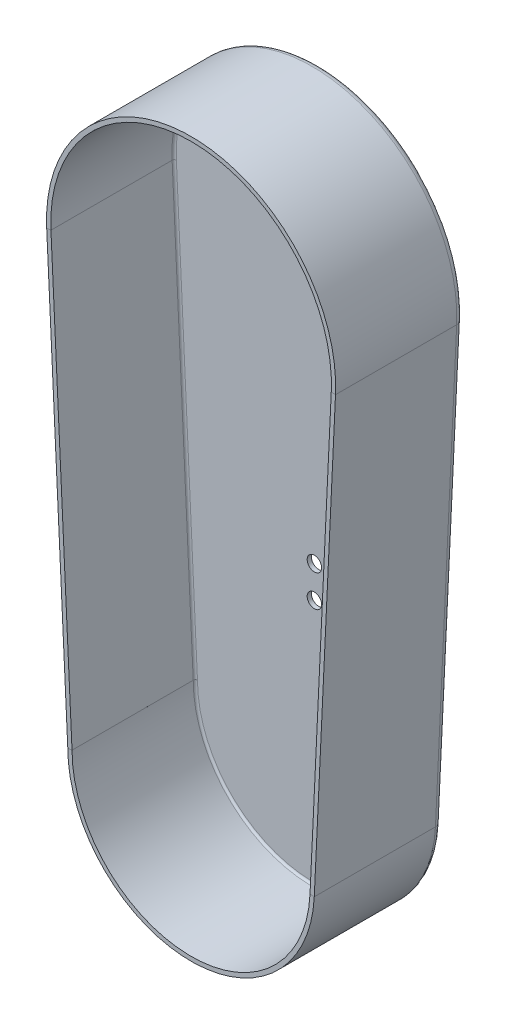
ISO-10303-21;
HEADER;
FILE_DESCRIPTION(('STEP AP214'),'2;1');
FILE_NAME('part.step','',(''),(''),'','','');
FILE_SCHEMA(('AUTOMOTIVE_DESIGN { 1 0 10303 214 1 1 1 1 }'));
ENDSEC;
DATA;
#1=APPLICATION_CONTEXT('core data for automotive mechanical design processes');
#2=APPLICATION_PROTOCOL_DEFINITION('international standard','automotive_design',2000,#1);
#3=PRODUCT_CONTEXT('',#1,'mechanical');
#4=PRODUCT('Part','Part','',(#3));
#5=PRODUCT_RELATED_PRODUCT_CATEGORY('part','',(#4));
#6=PRODUCT_DEFINITION_FORMATION('','',#4);
#7=PRODUCT_DEFINITION_CONTEXT('part definition',#1,'design');
#8=PRODUCT_DEFINITION('design','',#6,#7);
#9=PRODUCT_DEFINITION_SHAPE('','',#8);
#10=(LENGTH_UNIT() NAMED_UNIT(*) SI_UNIT(.MILLI.,.METRE.));
#11=(NAMED_UNIT(*) PLANE_ANGLE_UNIT() SI_UNIT($,.RADIAN.));
#12=(NAMED_UNIT(*) SI_UNIT($,.STERADIAN.) SOLID_ANGLE_UNIT());
#13=UNCERTAINTY_MEASURE_WITH_UNIT(LENGTH_MEASURE(1.E-05),#10,'distance_accuracy_value','');
#14=(GEOMETRIC_REPRESENTATION_CONTEXT(3) GLOBAL_UNCERTAINTY_ASSIGNED_CONTEXT((#13)) GLOBAL_UNIT_ASSIGNED_CONTEXT((#10,
#11,#12)) REPRESENTATION_CONTEXT('',''));
#15=CARTESIAN_POINT('',(0.,0.,0.));
#16=DIRECTION('',(0.,0.,1.));
#17=DIRECTION('',(1.,0.,0.));
#18=AXIS2_PLACEMENT_3D('',#15,#16,#17);
#19=CARTESIAN_POINT('',(-55.,0.,1.));
#20=DIRECTION('',(-0.047919928966273,0.998851180310594,0.));
#21=DIRECTION('',(-0.998851180310594,-0.047919928966273,0.));
#22=AXIS2_PLACEMENT_3D('',#19,#20,#21);
#23=PLANE('',#22);
#24=DIRECTION('',(0.998851180310594,0.0479199289662717,0.));
#25=VECTOR('',#24,1.);
#26=CARTESIAN_POINT('',(-55.9988511803106,-0.0479199289662724,0.999999999999999));
#27=LINE('',#26,#25);
#28=CARTESIAN_POINT('',(-57.9965535409318,-0.143759786898928,1.));
#29=VERTEX_POINT('',#28);
#30=CARTESIAN_POINT('',(-55.9988511803106,-0.0479199289662724,0.999999999999999));
#31=VERTEX_POINT('',#30);
#32=EDGE_CURVE('E228',#29,#31,#27,.T.);
#33=ORIENTED_EDGE('',*,*,#32,.F.);
#34=CARTESIAN_POINT('',(-55.,0.,1.));
#35=DIRECTION('',(0.047919928966273,-0.998851180310594,0.));
#36=DIRECTION('',(0.998851180310594,0.047919928966273,0.));
#37=AXIS2_PLACEMENT_3D('',#34,#35,#36);
#38=CIRCLE('',#37,3.);
#39=CARTESIAN_POINT('',(-54.9999999999999,0.,-2.));
#40=VERTEX_POINT('',#39);
#41=EDGE_CURVE('E322',#40,#29,#38,.F.);
#42=ORIENTED_EDGE('',*,*,#41,.F.);
#43=DIRECTION('',(0.,0.,1.));
#44=VECTOR('',#43,1.);
#45=CARTESIAN_POINT('',(-55.,0.,-2.));
#46=LINE('',#45,#44);
#47=CARTESIAN_POINT('',(-54.9999999999999,0.,0.));
#48=VERTEX_POINT('',#47);
#49=EDGE_CURVE('E178',#40,#48,#46,.T.);
#50=ORIENTED_EDGE('',*,*,#49,.T.);
#51=CARTESIAN_POINT('',(-55.,0.,1.));
#52=DIRECTION('',(0.047919928966273,-0.998851180310594,0.));
#53=DIRECTION('',(0.998851180310594,0.047919928966273,0.));
#54=AXIS2_PLACEMENT_3D('',#51,#52,#53);
#55=CIRCLE('',#54,1.);
#56=EDGE_CURVE('E298',#48,#31,#55,.F.);
#57=ORIENTED_EDGE('',*,*,#56,.T.);
#58=EDGE_LOOP('',(#33,#42,#50,#57));
#59=FACE_BOUND('',#58,.T.);
#60=ADVANCED_FACE('F174',(#59),#23,.F.);
#61=CARTESIAN_POINT('',(54.9376063327222,-2.61904761904764,1.));
#62=DIRECTION('',(-0.0476190476190477,-0.998865569685859,0.));
#63=DIRECTION('',(0.998865569685859,-0.0476190476190477,0.));
#64=AXIS2_PLACEMENT_3D('',#61,#62,#63);
#65=PLANE('',#64);
#66=DIRECTION('',(0.,0.,1.));
#67=VECTOR('',#66,1.);
#68=CARTESIAN_POINT('',(54.9376063327222,-2.61904761904762,-2.));
#69=LINE('',#68,#67);
#70=CARTESIAN_POINT('',(54.9376063327222,-2.61904761904764,-2.));
#71=VERTEX_POINT('',#70);
#72=CARTESIAN_POINT('',(54.9376063327222,-2.61904761904764,0.));
#73=VERTEX_POINT('',#72);
#74=EDGE_CURVE('E12',#71,#73,#69,.T.);
#75=ORIENTED_EDGE('',*,*,#74,.F.);
#76=CARTESIAN_POINT('',(54.9376063327222,-2.61904761904764,1.));
#77=DIRECTION('',(0.0476190476190477,0.998865569685859,0.));
#78=DIRECTION('',(-0.998865569685859,0.0476190476190477,0.));
#79=AXIS2_PLACEMENT_3D('',#76,#77,#78);
#80=CIRCLE('',#79,3.);
#81=CARTESIAN_POINT('',(57.9342030417798,-2.76190476190478,0.999999999999998));
#82=VERTEX_POINT('',#81);
#83=EDGE_CURVE('E347',#71,#82,#80,.F.);
#84=ORIENTED_EDGE('',*,*,#83,.T.);
#85=DIRECTION('',(-0.998865569685859,0.0476190476190477,0.));
#86=VECTOR('',#85,1.);
#87=CARTESIAN_POINT('',(55.936471902408,-2.66666666666669,0.999999999999999));
#88=LINE('',#87,#86);
#89=CARTESIAN_POINT('',(55.936471902408,-2.66666666666669,0.999999999999999));
#90=VERTEX_POINT('',#89);
#91=EDGE_CURVE('E356',#82,#90,#88,.T.);
#92=ORIENTED_EDGE('',*,*,#91,.T.);
#93=CARTESIAN_POINT('',(54.9376063327222,-2.61904761904764,1.));
#94=DIRECTION('',(0.0476190476190477,0.998865569685859,0.));
#95=DIRECTION('',(-0.998865569685858,0.0476190476190477,0.));
#96=AXIS2_PLACEMENT_3D('',#93,#94,#95);
#97=CIRCLE('',#96,1.);
#98=EDGE_CURVE('E342',#73,#90,#97,.F.);
#99=ORIENTED_EDGE('',*,*,#98,.F.);
#100=EDGE_LOOP('',(#75,#84,#92,#99));
#101=FACE_BOUND('',#100,.T.);
#102=ADVANCED_FACE('F393',(#101),#65,.T.);
#103=CARTESIAN_POINT('',(55.936471902408,-2.66666666666669,0.));
#104=DIRECTION('',(-0.0476190476190477,-0.998865569685859,0.));
#105=DIRECTION('',(0.,0.,1.));
#106=AXIS2_PLACEMENT_3D('',#103,#104,#105);
#107=PLANE('',#106);
#108=ORIENTED_EDGE('',*,*,#91,.F.);
#109=DIRECTION('',(0.,0.,1.));
#110=VECTOR('',#109,1.);
#111=CARTESIAN_POINT('',(57.9342030417798,-2.76190476190478,0.));
#112=LINE('',#111,#110);
#113=CARTESIAN_POINT('',(57.9342030417798,-2.76190476190478,58.));
#114=VERTEX_POINT('',#113);
#115=EDGE_CURVE('E338',#82,#114,#112,.T.);
#116=ORIENTED_EDGE('',*,*,#115,.T.);
#117=DIRECTION('',(-0.998865569685859,0.0476190476190477,0.));
#118=VECTOR('',#117,1.);
#119=CARTESIAN_POINT('',(55.936471902408,-2.66666666666669,58.));
#120=LINE('',#119,#118);
#121=CARTESIAN_POINT('',(55.936471902408,-2.66666666666669,58.));
#122=VERTEX_POINT('',#121);
#123=EDGE_CURVE('E277',#114,#122,#120,.T.);
#124=ORIENTED_EDGE('',*,*,#123,.T.);
#125=DIRECTION('',(0.,0.,1.));
#126=VECTOR('',#125,1.);
#127=CARTESIAN_POINT('',(55.936471902408,-2.66666666666669,0.));
#128=LINE('',#127,#126);
#129=EDGE_CURVE('E289',#90,#122,#128,.T.);
#130=ORIENTED_EDGE('',*,*,#129,.F.);
#131=EDGE_LOOP('',(#108,#116,#124,#130));
#132=FACE_BOUND('',#131,.T.);
#133=ADVANCED_FACE('F432',(#132),#107,.T.);
#134=CARTESIAN_POINT('',(55.936471902408,-2.66666666666669,58.));
#135=DIRECTION('',(0.,0.,1.));
#136=DIRECTION('',(0.0476190476190477,0.998865569685859,0.));
#137=AXIS2_PLACEMENT_3D('',#134,#135,#136);
#138=PLANE('',#137);
#139=ORIENTED_EDGE('',*,*,#123,.F.);
#140=DIRECTION('',(-0.0476190476190477,-0.998865569685859,0.));
#141=VECTOR('',#140,1.);
#142=CARTESIAN_POINT('',(57.9342030417798,-2.76190476190478,58.));
#143=LINE('',#142,#141);
#144=CARTESIAN_POINT('',(67.9228587386384,206.761904761905,58.));
#145=VERTEX_POINT('',#144);
#146=EDGE_CURVE('E272',#114,#145,#143,.F.);
#147=ORIENTED_EDGE('',*,*,#146,.T.);
#148=DIRECTION('',(-0.998865569685858,0.047619047619048,0.));
#149=VECTOR('',#148,1.);
#150=CARTESIAN_POINT('',(65.9251275992666,206.857142857143,58.));
#151=LINE('',#150,#149);
#152=CARTESIAN_POINT('',(65.9251275992666,206.857142857143,58.));
#153=VERTEX_POINT('',#152);
#154=EDGE_CURVE('E267',#145,#153,#151,.T.);
#155=ORIENTED_EDGE('',*,*,#154,.T.);
#156=DIRECTION('',(0.0476190476190477,0.998865569685859,0.));
#157=VECTOR('',#156,1.);
#158=CARTESIAN_POINT('',(55.936471902408,-2.66666666666669,58.));
#159=LINE('',#158,#157);
#160=EDGE_CURVE('E270',#122,#153,#159,.T.);
#161=ORIENTED_EDGE('',*,*,#160,.F.);
#162=EDGE_LOOP('',(#139,#147,#155,#161));
#163=FACE_BOUND('',#162,.T.);
#164=ADVANCED_FACE('F269',(#163),#138,.T.);
#165=CARTESIAN_POINT('',(0.,210.,58.));
#166=DIRECTION('',(0.,0.,-1.));
#167=DIRECTION('',(-1.,0.,0.));
#168=AXIS2_PLACEMENT_3D('',#165,#166,#167);
#169=PLANE('',#168);
#170=ORIENTED_EDGE('',*,*,#154,.F.);
#171=CARTESIAN_POINT('',(0.,210.,58.));
#172=DIRECTION('',(0.,0.,1.));
#173=DIRECTION('',(1.,0.,0.));
#174=AXIS2_PLACEMENT_3D('',#171,#172,#173);
#175=CIRCLE('',#174,68.);
#176=CARTESIAN_POINT('',(-67.9218802611204,206.741444830293,58.));
#177=VERTEX_POINT('',#176);
#178=EDGE_CURVE('E326',#145,#177,#175,.T.);
#179=ORIENTED_EDGE('',*,*,#178,.T.);
#180=DIRECTION('',(0.998851180310594,0.047919928966273,0.));
#181=VECTOR('',#180,1.);
#182=CARTESIAN_POINT('',(-65.9241779004992,206.837284688226,58.));
#183=LINE('',#182,#181);
#184=CARTESIAN_POINT('',(-65.9241779004992,206.837284688226,58.));
#185=VERTEX_POINT('',#184);
#186=EDGE_CURVE('E278',#177,#185,#183,.T.);
#187=ORIENTED_EDGE('',*,*,#186,.T.);
#188=CARTESIAN_POINT('',(0.,210.,58.));
#189=DIRECTION('',(0.,0.,1.));
#190=DIRECTION('',(0.998865569685859,-0.047619047619048,0.));
#191=AXIS2_PLACEMENT_3D('',#188,#189,#190);
#192=CIRCLE('',#191,66.);
#193=EDGE_CURVE('E294',#153,#185,#192,.T.);
#194=ORIENTED_EDGE('',*,*,#193,.F.);
#195=EDGE_LOOP('',(#170,#179,#187,#194));
#196=FACE_BOUND('',#195,.T.);
#197=ADVANCED_FACE('F295',(#196),#169,.F.);
#198=CARTESIAN_POINT('',(-65.9241779004992,206.837284688226,58.));
#199=DIRECTION('',(0.,0.,1.));
#200=DIRECTION('',(0.047919928966273,-0.998851180310594,0.));
#201=AXIS2_PLACEMENT_3D('',#198,#199,#200);
#202=PLANE('',#201);
#203=ORIENTED_EDGE('',*,*,#186,.F.);
#204=DIRECTION('',(-0.047919928966273,0.998851180310594,0.));
#205=VECTOR('',#204,1.);
#206=CARTESIAN_POINT('',(-67.9218802611204,206.741444830293,58.));
#207=LINE('',#206,#205);
#208=CARTESIAN_POINT('',(-57.9965535409318,-0.143759786898928,58.));
#209=VERTEX_POINT('',#208);
#210=EDGE_CURVE('E340',#177,#209,#207,.F.);
#211=ORIENTED_EDGE('',*,*,#210,.T.);
#212=DIRECTION('',(0.998851180310594,0.047919928966273,0.));
#213=VECTOR('',#212,1.);
#214=CARTESIAN_POINT('',(-55.9988511803106,-0.0479199289662724,58.));
#215=LINE('',#214,#213);
#216=CARTESIAN_POINT('',(-55.9988511803106,-0.0479199289662724,58.));
#217=VERTEX_POINT('',#216);
#218=EDGE_CURVE('E191',#209,#217,#215,.T.);
#219=ORIENTED_EDGE('',*,*,#218,.T.);
#220=DIRECTION('',(0.047919928966273,-0.998851180310594,0.));
#221=VECTOR('',#220,1.);
#222=CARTESIAN_POINT('',(-65.9241779004992,206.837284688226,58.));
#223=LINE('',#222,#221);
#224=EDGE_CURVE('E315',#185,#217,#223,.T.);
#225=ORIENTED_EDGE('',*,*,#224,.F.);
#226=EDGE_LOOP('',(#203,#211,#219,#225));
#227=FACE_BOUND('',#226,.T.);
#228=ADVANCED_FACE('F438',(#227),#202,.T.);
#229=CARTESIAN_POINT('',(-55.9988511803106,-0.0479199289662661,0.));
#230=DIRECTION('',(-0.047919928966273,0.998851180310594,0.));
#231=DIRECTION('',(0.,0.,1.));
#232=AXIS2_PLACEMENT_3D('',#229,#230,#231);
#233=PLANE('',#232);
#234=DIRECTION('',(0.,0.,1.));
#235=VECTOR('',#234,1.);
#236=CARTESIAN_POINT('',(-57.9965535409318,-0.143759786898928,0.));
#237=LINE('',#236,#235);
#238=EDGE_CURVE('E321',#29,#209,#237,.T.);
#239=ORIENTED_EDGE('',*,*,#238,.F.);
#240=ORIENTED_EDGE('',*,*,#32,.T.);
#241=DIRECTION('',(0.,0.,1.));
#242=VECTOR('',#241,1.);
#243=CARTESIAN_POINT('',(-55.9988511803106,-0.0479199289662661,0.));
#244=LINE('',#243,#242);
#245=EDGE_CURVE('E313',#31,#217,#244,.T.);
#246=ORIENTED_EDGE('',*,*,#245,.T.);
#247=ORIENTED_EDGE('',*,*,#218,.F.);
#248=EDGE_LOOP('',(#239,#240,#246,#247));
#249=FACE_BOUND('',#248,.T.);
#250=ADVANCED_FACE('F436',(#249),#233,.F.);
#251=CARTESIAN_POINT('',(-65.9241779004992,206.837284688226,0.));
#252=DIRECTION('',(0.998851180310594,0.047919928966273,0.));
#253=DIRECTION('',(-0.047919928966273,0.998851180310594,0.));
#254=AXIS2_PLACEMENT_3D('',#251,#252,#253);
#255=PLANE('',#254);
#256=ORIENTED_EDGE('',*,*,#224,.T.);
#257=ORIENTED_EDGE('',*,*,#245,.F.);
#258=DIRECTION('',(0.047919928966273,-0.998851180310594,0.));
#259=VECTOR('',#258,1.);
#260=CARTESIAN_POINT('',(-65.9241779004992,206.837284688226,0.999999999999999));
#261=LINE('',#260,#259);
#262=CARTESIAN_POINT('',(-65.9241779004992,206.837284688226,0.999999999999999));
#263=VERTEX_POINT('',#262);
#264=EDGE_CURVE('E316',#263,#31,#261,.T.);
#265=ORIENTED_EDGE('',*,*,#264,.F.);
#266=DIRECTION('',(0.,0.,1.));
#267=VECTOR('',#266,1.);
#268=CARTESIAN_POINT('',(-65.9241779004992,206.837284688226,0.));
#269=LINE('',#268,#267);
#270=EDGE_CURVE('E299',#263,#185,#269,.T.);
#271=ORIENTED_EDGE('',*,*,#270,.T.);
#272=EDGE_LOOP('',(#256,#257,#265,#271));
#273=FACE_BOUND('',#272,.T.);
#274=ADVANCED_FACE('F414',(#273),#255,.T.);
#275=CARTESIAN_POINT('',(-64.9253267201886,206.885204617192,1.));
#276=DIRECTION('',(0.047919928966273,-0.998851180310594,0.));
#277=DIRECTION('',(0.998851180310594,0.047919928966273,0.));
#278=AXIS2_PLACEMENT_3D('',#275,#276,#277);
#279=CYLINDRICAL_SURFACE('',#278,1.);
#280=ORIENTED_EDGE('',*,*,#264,.T.);
#281=ORIENTED_EDGE('',*,*,#56,.F.);
#282=DIRECTION('',(0.047919928966273,-0.998851180310594,0.));
#283=VECTOR('',#282,1.);
#284=CARTESIAN_POINT('',(-64.9253267201886,206.885204617192,0.));
#285=LINE('',#284,#283);
#286=CARTESIAN_POINT('',(-64.9253267201886,206.885204617192,0.));
#287=VERTEX_POINT('',#286);
#288=EDGE_CURVE('E376',#287,#48,#285,.T.);
#289=ORIENTED_EDGE('',*,*,#288,.F.);
#290=CARTESIAN_POINT('',(-64.9253267201886,206.885204617192,1.));
#291=DIRECTION('',(0.047919928966273,-0.998851180310594,0.));
#292=DIRECTION('',(0.998851180310594,0.047919928966273,0.));
#293=AXIS2_PLACEMENT_3D('',#290,#291,#292);
#294=CIRCLE('',#293,1.);
#295=EDGE_CURVE('E290',#287,#263,#294,.F.);
#296=ORIENTED_EDGE('',*,*,#295,.T.);
#297=EDGE_LOOP('',(#280,#281,#289,#296));
#298=FACE_BOUND('',#297,.T.);
#299=ADVANCED_FACE('F408',(#298),#279,.F.);
#300=CARTESIAN_POINT('',(0.,210.,0.));
#301=DIRECTION('',(0.,0.,1.));
#302=DIRECTION('',(1.,0.,0.));
#303=AXIS2_PLACEMENT_3D('',#300,#301,#302);
#304=CYLINDRICAL_SURFACE('',#303,66.);
#305=ORIENTED_EDGE('',*,*,#193,.T.);
#306=ORIENTED_EDGE('',*,*,#270,.F.);
#307=CARTESIAN_POINT('',(0.,210.,0.999999999999999));
#308=DIRECTION('',(0.,0.,1.));
#309=DIRECTION('',(0.998865569685859,-0.047619047619048,0.));
#310=AXIS2_PLACEMENT_3D('',#307,#308,#309);
#311=CIRCLE('',#310,66.);
#312=CARTESIAN_POINT('',(65.9251275992666,206.857142857143,0.999999999999999));
#313=VERTEX_POINT('',#312);
#314=EDGE_CURVE('E303',#313,#263,#311,.T.);
#315=ORIENTED_EDGE('',*,*,#314,.F.);
#316=DIRECTION('',(0.,0.,1.));
#317=VECTOR('',#316,1.);
#318=CARTESIAN_POINT('',(65.9251275992666,206.857142857143,0.));
#319=LINE('',#318,#317);
#320=EDGE_CURVE('E286',#313,#153,#319,.T.);
#321=ORIENTED_EDGE('',*,*,#320,.T.);
#322=EDGE_LOOP('',(#305,#306,#315,#321));
#323=FACE_BOUND('',#322,.T.);
#324=ADVANCED_FACE('F301',(#323),#304,.F.);
#325=CARTESIAN_POINT('',(0.,210.,1.));
#326=DIRECTION('',(0.,0.,1.));
#327=DIRECTION('',(1.,0.,0.));
#328=AXIS2_PLACEMENT_3D('',#325,#326,#327);
#329=TOROIDAL_SURFACE('',#328,65.,1.);
#330=ORIENTED_EDGE('',*,*,#314,.T.);
#331=ORIENTED_EDGE('',*,*,#295,.F.);
#332=CARTESIAN_POINT('',(0.,210.,0.));
#333=DIRECTION('',(0.,0.,1.));
#334=DIRECTION('',(1.,0.,0.));
#335=AXIS2_PLACEMENT_3D('',#332,#333,#334);
#336=CIRCLE('',#335,65.);
#337=CARTESIAN_POINT('',(64.9262620295808,206.904761904762,0.));
#338=VERTEX_POINT('',#337);
#339=EDGE_CURVE('E359',#338,#287,#336,.T.);
#340=ORIENTED_EDGE('',*,*,#339,.F.);
#341=CARTESIAN_POINT('',(64.9262620295808,206.904761904762,1.));
#342=DIRECTION('',(0.0476190476190477,0.998865569685859,0.));
#343=DIRECTION('',(-0.998865569685858,0.0476190476190477,0.));
#344=AXIS2_PLACEMENT_3D('',#341,#342,#343);
#345=CIRCLE('',#344,1.);
#346=EDGE_CURVE('E306',#338,#313,#345,.F.);
#347=ORIENTED_EDGE('',*,*,#346,.T.);
#348=EDGE_LOOP('',(#330,#331,#340,#347));
#349=FACE_BOUND('',#348,.T.);
#350=ADVANCED_FACE('F416',(#349),#329,.F.);
#351=CARTESIAN_POINT('',(55.936471902408,-2.66666666666669,0.));
#352=DIRECTION('',(-0.998865569685859,0.0476190476190477,0.));
#353=DIRECTION('',(-0.0476190476190477,-0.998865569685859,0.));
#354=AXIS2_PLACEMENT_3D('',#351,#352,#353);
#355=PLANE('',#354);
#356=ORIENTED_EDGE('',*,*,#160,.T.);
#357=ORIENTED_EDGE('',*,*,#320,.F.);
#358=DIRECTION('',(0.0476190476190477,0.998865569685859,0.));
#359=VECTOR('',#358,1.);
#360=CARTESIAN_POINT('',(55.936471902408,-2.66666666666669,0.999999999999999));
#361=LINE('',#360,#359);
#362=EDGE_CURVE('E304',#90,#313,#361,.T.);
#363=ORIENTED_EDGE('',*,*,#362,.F.);
#364=ORIENTED_EDGE('',*,*,#129,.T.);
#365=EDGE_LOOP('',(#356,#357,#363,#364));
#366=FACE_BOUND('',#365,.T.);
#367=ADVANCED_FACE('F283',(#366),#355,.T.);
#368=CARTESIAN_POINT('',(54.9376063327222,-2.61904761904764,1.));
#369=DIRECTION('',(0.0476190476190477,0.998865569685859,0.));
#370=DIRECTION('',(-0.998865569685859,0.0476190476190477,0.));
#371=AXIS2_PLACEMENT_3D('',#368,#369,#370);
#372=CYLINDRICAL_SURFACE('',#371,1.);
#373=ORIENTED_EDGE('',*,*,#362,.T.);
#374=ORIENTED_EDGE('',*,*,#346,.F.);
#375=DIRECTION('',(0.0476190476190477,0.998865569685859,0.));
#376=VECTOR('',#375,1.);
#377=CARTESIAN_POINT('',(64.9262620295808,206.904761904762,0.));
#378=LINE('',#377,#376);
#379=EDGE_CURVE('E365',#73,#338,#378,.T.);
#380=ORIENTED_EDGE('',*,*,#379,.F.);
#381=ORIENTED_EDGE('',*,*,#98,.T.);
#382=EDGE_LOOP('',(#373,#374,#380,#381));
#383=FACE_BOUND('',#382,.T.);
#384=ADVANCED_FACE('F389',(#383),#372,.F.);
#385=CARTESIAN_POINT('',(-67.9218802611204,206.741444830293,0.));
#386=DIRECTION('',(0.998851180310594,0.047919928966273,0.));
#387=DIRECTION('',(-0.047919928966273,0.998851180310594,0.));
#388=AXIS2_PLACEMENT_3D('',#385,#386,#387);
#389=PLANE('',#388);
#390=ORIENTED_EDGE('',*,*,#210,.F.);
#391=DIRECTION('',(0.,0.,1.));
#392=VECTOR('',#391,1.);
#393=CARTESIAN_POINT('',(-67.9218802611204,206.741444830293,0.));
#394=LINE('',#393,#392);
#395=CARTESIAN_POINT('',(-67.9218802611204,206.741444830293,1.));
#396=VERTEX_POINT('',#395);
#397=EDGE_CURVE('E323',#396,#177,#394,.T.);
#398=ORIENTED_EDGE('',*,*,#397,.F.);
#399=DIRECTION('',(0.047919928966273,-0.998851180310594,0.));
#400=VECTOR('',#399,1.);
#401=CARTESIAN_POINT('',(-67.9218802611204,206.741444830293,0.999999999999998));
#402=LINE('',#401,#400);
#403=EDGE_CURVE('E319',#396,#29,#402,.T.);
#404=ORIENTED_EDGE('',*,*,#403,.T.);
#405=ORIENTED_EDGE('',*,*,#238,.T.);
#406=EDGE_LOOP('',(#390,#398,#404,#405));
#407=FACE_BOUND('',#406,.T.);
#408=ADVANCED_FACE('F566',(#407),#389,.F.);
#409=CARTESIAN_POINT('',(-64.9253267201886,206.885204617192,1.));
#410=DIRECTION('',(0.047919928966273,-0.998851180310594,0.));
#411=DIRECTION('',(0.998851180310594,0.047919928966273,0.));
#412=AXIS2_PLACEMENT_3D('',#409,#410,#411);
#413=CYLINDRICAL_SURFACE('',#412,3.);
#414=ORIENTED_EDGE('',*,*,#403,.F.);
#415=CARTESIAN_POINT('',(-64.9253267201886,206.885204617192,1.));
#416=DIRECTION('',(0.047919928966273,-0.998851180310594,0.));
#417=DIRECTION('',(0.998851180310594,0.047919928966273,0.));
#418=AXIS2_PLACEMENT_3D('',#415,#416,#417);
#419=CIRCLE('',#418,3.);
#420=CARTESIAN_POINT('',(-64.9253267201885,206.885204617192,-2.));
#421=VERTEX_POINT('',#420);
#422=EDGE_CURVE('E328',#421,#396,#419,.F.);
#423=ORIENTED_EDGE('',*,*,#422,.F.);
#424=DIRECTION('',(0.047919928966273,-0.998851180310594,0.));
#425=VECTOR('',#424,1.);
#426=CARTESIAN_POINT('',(-64.9253267201886,206.885204617192,-2.));
#427=LINE('',#426,#425);
#428=EDGE_CURVE('E364',#421,#40,#427,.T.);
#429=ORIENTED_EDGE('',*,*,#428,.T.);
#430=ORIENTED_EDGE('',*,*,#41,.T.);
#431=EDGE_LOOP('',(#414,#423,#429,#430));
#432=FACE_BOUND('',#431,.T.);
#433=ADVANCED_FACE('F562',(#432),#413,.T.);
#434=CARTESIAN_POINT('',(0.,210.,0.));
#435=DIRECTION('',(0.,0.,1.));
#436=DIRECTION('',(1.,0.,0.));
#437=AXIS2_PLACEMENT_3D('',#434,#435,#436);
#438=CYLINDRICAL_SURFACE('',#437,68.);
#439=ORIENTED_EDGE('',*,*,#178,.F.);
#440=DIRECTION('',(0.,0.,1.));
#441=VECTOR('',#440,1.);
#442=CARTESIAN_POINT('',(67.9228587386384,206.761904761905,0.));
#443=LINE('',#442,#441);
#444=CARTESIAN_POINT('',(67.9228587386384,206.761904761905,0.999999999999999));
#445=VERTEX_POINT('',#444);
#446=EDGE_CURVE('E332',#445,#145,#443,.T.);
#447=ORIENTED_EDGE('',*,*,#446,.F.);
#448=CARTESIAN_POINT('',(0.,210.,0.999999999999997));
#449=DIRECTION('',(0.,0.,1.));
#450=DIRECTION('',(1.,0.,0.));
#451=AXIS2_PLACEMENT_3D('',#448,#449,#450);
#452=CIRCLE('',#451,68.);
#453=EDGE_CURVE('E327',#445,#396,#452,.T.);
#454=ORIENTED_EDGE('',*,*,#453,.T.);
#455=ORIENTED_EDGE('',*,*,#397,.T.);
#456=EDGE_LOOP('',(#439,#447,#454,#455));
#457=FACE_BOUND('',#456,.T.);
#458=ADVANCED_FACE('F569',(#457),#438,.T.);
#459=CARTESIAN_POINT('',(0.,210.,1.));
#460=DIRECTION('',(0.,0.,1.));
#461=DIRECTION('',(1.,0.,0.));
#462=AXIS2_PLACEMENT_3D('',#459,#460,#461);
#463=TOROIDAL_SURFACE('',#462,65.,3.);
#464=ORIENTED_EDGE('',*,*,#453,.F.);
#465=CARTESIAN_POINT('',(64.9262620295808,206.904761904762,1.));
#466=DIRECTION('',(-0.0476190476190481,-0.998865569685859,0.));
#467=DIRECTION('',(0.998865569685859,-0.0476190476190481,0.));
#468=AXIS2_PLACEMENT_3D('',#465,#466,#467);
#469=CIRCLE('',#468,3.);
#470=CARTESIAN_POINT('',(64.9262620295807,206.904761904762,-2.));
#471=VERTEX_POINT('',#470);
#472=EDGE_CURVE('E335',#471,#445,#469,.T.);
#473=ORIENTED_EDGE('',*,*,#472,.F.);
#474=CARTESIAN_POINT('',(0.,210.,-2.));
#475=DIRECTION('',(0.,0.,1.));
#476=DIRECTION('',(1.,0.,0.));
#477=AXIS2_PLACEMENT_3D('',#474,#475,#476);
#478=CIRCLE('',#477,65.);
#479=EDGE_CURVE('E361',#471,#421,#478,.T.);
#480=ORIENTED_EDGE('',*,*,#479,.T.);
#481=ORIENTED_EDGE('',*,*,#422,.T.);
#482=EDGE_LOOP('',(#464,#473,#480,#481));
#483=FACE_BOUND('',#482,.T.);
#484=ADVANCED_FACE('F466',(#483),#463,.T.);
#485=CARTESIAN_POINT('',(57.9342030417798,-2.76190476190478,0.));
#486=DIRECTION('',(-0.998865569685859,0.0476190476190477,0.));
#487=DIRECTION('',(-0.0476190476190477,-0.998865569685859,0.));
#488=AXIS2_PLACEMENT_3D('',#485,#486,#487);
#489=PLANE('',#488);
#490=ORIENTED_EDGE('',*,*,#146,.F.);
#491=ORIENTED_EDGE('',*,*,#115,.F.);
#492=DIRECTION('',(0.0476190476190477,0.998865569685859,0.));
#493=VECTOR('',#492,1.);
#494=CARTESIAN_POINT('',(57.9342030417798,-2.76190476190478,0.999999999999998));
#495=LINE('',#494,#493);
#496=EDGE_CURVE('E334',#82,#445,#495,.T.);
#497=ORIENTED_EDGE('',*,*,#496,.T.);
#498=ORIENTED_EDGE('',*,*,#446,.T.);
#499=EDGE_LOOP('',(#490,#491,#497,#498));
#500=FACE_BOUND('',#499,.T.);
#501=ADVANCED_FACE('F449',(#500),#489,.F.);
#502=CARTESIAN_POINT('',(54.9376063327222,-2.61904761904764,1.));
#503=DIRECTION('',(0.0476190476190477,0.998865569685859,0.));
#504=DIRECTION('',(-0.998865569685859,0.0476190476190477,0.));
#505=AXIS2_PLACEMENT_3D('',#502,#503,#504);
#506=CYLINDRICAL_SURFACE('',#505,3.);
#507=ORIENTED_EDGE('',*,*,#496,.F.);
#508=ORIENTED_EDGE('',*,*,#83,.F.);
#509=DIRECTION('',(0.0476190476190477,0.998865569685859,0.));
#510=VECTOR('',#509,1.);
#511=CARTESIAN_POINT('',(64.9262620295808,206.904761904762,-2.));
#512=LINE('',#511,#510);
#513=EDGE_CURVE('E371',#71,#471,#512,.T.);
#514=ORIENTED_EDGE('',*,*,#513,.T.);
#515=ORIENTED_EDGE('',*,*,#472,.T.);
#516=EDGE_LOOP('',(#507,#508,#514,#515));
#517=FACE_BOUND('',#516,.T.);
#518=ADVANCED_FACE('F441',(#517),#506,.T.);
#519=CARTESIAN_POINT('',(0.,210.,-2.));
#520=DIRECTION('',(0.,0.,1.));
#521=DIRECTION('',(1.,0.,0.));
#522=AXIS2_PLACEMENT_3D('',#519,#520,#521);
#523=PLANE('',#522);
#524=CARTESIAN_POINT('',(0.,75.,-2.));
#525=DIRECTION('',(0.,0.,-1.));
#526=DIRECTION('',(-1.,0.,0.));
#527=AXIS2_PLACEMENT_3D('',#524,#525,#526);
#528=CIRCLE('',#527,3.4);
#529=CARTESIAN_POINT('',(-3.39999999999999,75.,-2.));
#530=VERTEX_POINT('',#529);
#531=EDGE_CURVE('E455',#530,#530,#528,.T.);
#532=ORIENTED_EDGE('',*,*,#531,.F.);
#533=EDGE_LOOP('',(#532));
#534=FACE_BOUND('',#533,.T.);
#535=CARTESIAN_POINT('',(0.,60.,-2.));
#536=DIRECTION('',(0.,0.,-1.));
#537=DIRECTION('',(-1.,0.,0.));
#538=AXIS2_PLACEMENT_3D('',#535,#536,#537);
#539=CIRCLE('',#538,3.4);
#540=CARTESIAN_POINT('',(-3.39999999999999,60.,-2.));
#541=VERTEX_POINT('',#540);
#542=EDGE_CURVE('E459',#541,#541,#539,.T.);
#543=ORIENTED_EDGE('',*,*,#542,.F.);
#544=EDGE_LOOP('',(#543));
#545=FACE_BOUND('',#544,.T.);
#546=ORIENTED_EDGE('',*,*,#479,.F.);
#547=ORIENTED_EDGE('',*,*,#513,.F.);
#548=CARTESIAN_POINT('',(0.,0.,-2.));
#549=DIRECTION('',(0.,0.,1.));
#550=DIRECTION('',(1.,0.,0.));
#551=AXIS2_PLACEMENT_3D('',#548,#549,#550);
#552=CIRCLE('',#551,55.);
#553=EDGE_CURVE('E368',#40,#71,#552,.T.);
#554=ORIENTED_EDGE('',*,*,#553,.F.);
#555=ORIENTED_EDGE('',*,*,#428,.F.);
#556=EDGE_LOOP('',(#546,#547,#554,#555));
#557=FACE_BOUND('',#556,.T.);
#558=ADVANCED_FACE('F439',(#534,#545,#557),#523,.F.);
#559=CARTESIAN_POINT('',(0.,210.,0.));
#560=DIRECTION('',(0.,0.,1.));
#561=DIRECTION('',(1.,0.,0.));
#562=AXIS2_PLACEMENT_3D('',#559,#560,#561);
#563=PLANE('',#562);
#564=CARTESIAN_POINT('',(0.,75.,0.));
#565=DIRECTION('',(0.,0.,1.));
#566=DIRECTION('',(1.,0.,0.));
#567=AXIS2_PLACEMENT_3D('',#564,#565,#566);
#568=CIRCLE('',#567,3.4);
#569=CARTESIAN_POINT('',(3.40000000000001,75.,0.));
#570=VERTEX_POINT('',#569);
#571=EDGE_CURVE('E864',#570,#570,#568,.T.);
#572=ORIENTED_EDGE('',*,*,#571,.F.);
#573=EDGE_LOOP('',(#572));
#574=FACE_BOUND('',#573,.T.);
#575=CARTESIAN_POINT('',(0.,60.,0.));
#576=DIRECTION('',(0.,0.,1.));
#577=DIRECTION('',(1.,0.,0.));
#578=AXIS2_PLACEMENT_3D('',#575,#576,#577);
#579=CIRCLE('',#578,3.4);
#580=CARTESIAN_POINT('',(3.4,60.,0.));
#581=VERTEX_POINT('',#580);
#582=EDGE_CURVE('E540',#581,#581,#579,.T.);
#583=ORIENTED_EDGE('',*,*,#582,.F.);
#584=EDGE_LOOP('',(#583));
#585=FACE_BOUND('',#584,.T.);
#586=ORIENTED_EDGE('',*,*,#339,.T.);
#587=ORIENTED_EDGE('',*,*,#288,.T.);
#588=CARTESIAN_POINT('',(0.,0.,0.));
#589=DIRECTION('',(0.,0.,1.));
#590=DIRECTION('',(1.,0.,0.));
#591=AXIS2_PLACEMENT_3D('',#588,#589,#590);
#592=CIRCLE('',#591,55.);
#593=EDGE_CURVE('E379',#48,#73,#592,.T.);
#594=ORIENTED_EDGE('',*,*,#593,.T.);
#595=ORIENTED_EDGE('',*,*,#379,.T.);
#596=EDGE_LOOP('',(#586,#587,#594,#595));
#597=FACE_BOUND('',#596,.T.);
#598=ADVANCED_FACE('F176',(#574,#585,#597),#563,.T.);
#599=CARTESIAN_POINT('',(54.9376063327221,-2.61904761904764,1.));
#600=DIRECTION('',(-0.0476190476190481,-0.998865569685859,0.));
#601=DIRECTION('',(0.998865569685859,-0.0476190476190481,0.));
#602=AXIS2_PLACEMENT_3D('',#599,#600,#601);
#603=PLANE('',#602);
#604=DIRECTION('',(-0.998865569685859,0.0476190476190478,0.));
#605=VECTOR('',#604,1.);
#606=CARTESIAN_POINT('',(55.936471902408,-2.66666666666668,1.));
#607=LINE('',#606,#605);
#608=CARTESIAN_POINT('',(57.9342030417797,-2.76190476190479,1.));
#609=VERTEX_POINT('',#608);
#610=CARTESIAN_POINT('',(55.936471902408,-2.66666666666668,1.));
#611=VERTEX_POINT('',#610);
#612=EDGE_CURVE('E350',#609,#611,#607,.T.);
#613=ORIENTED_EDGE('',*,*,#612,.F.);
#614=CARTESIAN_POINT('',(54.9376063327222,-2.61904761904764,1.));
#615=DIRECTION('',(-0.0476190476190481,-0.998865569685859,0.));
#616=DIRECTION('',(0.998865569685859,-0.0476190476190481,0.));
#617=AXIS2_PLACEMENT_3D('',#614,#615,#616);
#618=CIRCLE('',#617,3.);
#619=EDGE_CURVE('E536',#71,#609,#618,.T.);
#620=ORIENTED_EDGE('',*,*,#619,.F.);
#621=ORIENTED_EDGE('',*,*,#74,.T.);
#622=CARTESIAN_POINT('',(54.9376063327221,-2.61904761904764,1.));
#623=DIRECTION('',(0.0476190476190481,0.998865569685859,0.));
#624=DIRECTION('',(-0.998865569685859,0.0476190476190481,0.));
#625=AXIS2_PLACEMENT_3D('',#622,#623,#624);
#626=CIRCLE('',#625,1.);
#627=EDGE_CURVE('E241',#73,#611,#626,.F.);
#628=ORIENTED_EDGE('',*,*,#627,.T.);
#629=EDGE_LOOP('',(#613,#620,#621,#628));
#630=FACE_BOUND('',#629,.T.);
#631=ADVANCED_FACE('F447',(#630),#603,.F.);
#632=CARTESIAN_POINT('',(-54.9999999999999,0.,1.));
#633=DIRECTION('',(0.,1.,0.));
#634=DIRECTION('',(-1.,0.,0.));
#635=AXIS2_PLACEMENT_3D('',#632,#633,#634);
#636=PLANE('',#635);
#637=ORIENTED_EDGE('',*,*,#49,.F.);
#638=CARTESIAN_POINT('',(-54.9999999999999,0.,1.));
#639=DIRECTION('',(0.,1.,0.));
#640=DIRECTION('',(-1.,0.,0.));
#641=AXIS2_PLACEMENT_3D('',#638,#639,#640);
#642=CIRCLE('',#641,3.);
#643=CARTESIAN_POINT('',(-57.9999999999999,0.,1.));
#644=VERTEX_POINT('',#643);
#645=EDGE_CURVE('E537',#40,#644,#642,.T.);
#646=ORIENTED_EDGE('',*,*,#645,.T.);
#647=DIRECTION('',(1.,0.,0.));
#648=VECTOR('',#647,1.);
#649=CARTESIAN_POINT('',(-55.9999999999999,0.,1.));
#650=LINE('',#649,#648);
#651=CARTESIAN_POINT('',(-55.9999999999999,0.,1.));
#652=VERTEX_POINT('',#651);
#653=EDGE_CURVE('E543',#644,#652,#650,.T.);
#654=ORIENTED_EDGE('',*,*,#653,.T.);
#655=CARTESIAN_POINT('',(-54.9999999999999,0.,1.));
#656=DIRECTION('',(0.,-1.,0.));
#657=DIRECTION('',(1.,0.,0.));
#658=AXIS2_PLACEMENT_3D('',#655,#656,#657);
#659=CIRCLE('',#658,1.);
#660=EDGE_CURVE('E527',#48,#652,#659,.F.);
#661=ORIENTED_EDGE('',*,*,#660,.F.);
#662=EDGE_LOOP('',(#637,#646,#654,#661));
#663=FACE_BOUND('',#662,.T.);
#664=ADVANCED_FACE('F559',(#663),#636,.T.);
#665=CARTESIAN_POINT('',(-55.9999999999999,0.,29.5));
#666=DIRECTION('',(0.,-1.,0.));
#667=DIRECTION('',(0.,0.,1.));
#668=AXIS2_PLACEMENT_3D('',#665,#666,#667);
#669=PLANE('',#668);
#670=ORIENTED_EDGE('',*,*,#653,.F.);
#671=DIRECTION('',(0.,0.,1.));
#672=VECTOR('',#671,1.);
#673=CARTESIAN_POINT('',(-57.9999999999999,0.,0.));
#674=LINE('',#673,#672);
#675=CARTESIAN_POINT('',(-57.9999999999999,0.,58.));
#676=VERTEX_POINT('',#675);
#677=EDGE_CURVE('E534',#644,#676,#674,.T.);
#678=ORIENTED_EDGE('',*,*,#677,.T.);
#679=DIRECTION('',(1.,0.,0.));
#680=VECTOR('',#679,1.);
#681=CARTESIAN_POINT('',(-55.9999999999999,0.,58.));
#682=LINE('',#681,#680);
#683=CARTESIAN_POINT('',(-55.9999999999999,0.,58.));
#684=VERTEX_POINT('',#683);
#685=EDGE_CURVE('E514',#676,#684,#682,.T.);
#686=ORIENTED_EDGE('',*,*,#685,.T.);
#687=DIRECTION('',(0.,0.,1.));
#688=VECTOR('',#687,1.);
#689=CARTESIAN_POINT('',(-55.9999999999999,0.,0.));
#690=LINE('',#689,#688);
#691=EDGE_CURVE('E529',#652,#684,#690,.T.);
#692=ORIENTED_EDGE('',*,*,#691,.F.);
#693=EDGE_LOOP('',(#670,#678,#686,#692));
#694=FACE_BOUND('',#693,.T.);
#695=ADVANCED_FACE('F557',(#694),#669,.F.);
#696=CARTESIAN_POINT('',(0.,0.,58.));
#697=DIRECTION('',(0.,0.,-1.));
#698=DIRECTION('',(-1.,0.,0.));
#699=AXIS2_PLACEMENT_3D('',#696,#697,#698);
#700=PLANE('',#699);
#701=ORIENTED_EDGE('',*,*,#685,.F.);
#702=CARTESIAN_POINT('',(0.,0.,58.));
#703=DIRECTION('',(0.,0.,1.));
#704=DIRECTION('',(1.,0.,0.));
#705=AXIS2_PLACEMENT_3D('',#702,#703,#704);
#706=CIRCLE('',#705,57.9999999999999);
#707=CARTESIAN_POINT('',(57.9342030417797,-2.76190476190479,58.));
#708=VERTEX_POINT('',#707);
#709=EDGE_CURVE('E521',#676,#708,#706,.T.);
#710=ORIENTED_EDGE('',*,*,#709,.T.);
#711=DIRECTION('',(-0.998865569685859,0.047619047619048,0.));
#712=VECTOR('',#711,1.);
#713=CARTESIAN_POINT('',(55.936471902408,-2.66666666666668,58.));
#714=LINE('',#713,#712);
#715=CARTESIAN_POINT('',(55.936471902408,-2.66666666666668,58.));
#716=VERTEX_POINT('',#715);
#717=EDGE_CURVE('E399',#708,#716,#714,.T.);
#718=ORIENTED_EDGE('',*,*,#717,.T.);
#719=CARTESIAN_POINT('',(0.,0.,58.));
#720=DIRECTION('',(0.,0.,1.));
#721=DIRECTION('',(-1.,0.,0.));
#722=AXIS2_PLACEMENT_3D('',#719,#720,#721);
#723=CIRCLE('',#722,55.9999999999999);
#724=EDGE_CURVE('E515',#684,#716,#723,.T.);
#725=ORIENTED_EDGE('',*,*,#724,.F.);
#726=EDGE_LOOP('',(#701,#710,#718,#725));
#727=FACE_BOUND('',#726,.T.);
#728=ADVANCED_FACE('F525',(#727),#700,.F.);
#729=CARTESIAN_POINT('',(55.936471902408,-2.66666666666668,29.5));
#730=DIRECTION('',(0.047619047619048,0.998865569685859,0.));
#731=DIRECTION('',(0.,0.,1.));
#732=AXIS2_PLACEMENT_3D('',#729,#730,#731);
#733=PLANE('',#732);
#734=DIRECTION('',(0.,0.,1.));
#735=VECTOR('',#734,1.);
#736=CARTESIAN_POINT('',(57.9342030417797,-2.76190476190479,0.));
#737=LINE('',#736,#735);
#738=EDGE_CURVE('E507',#609,#708,#737,.T.);
#739=ORIENTED_EDGE('',*,*,#738,.F.);
#740=ORIENTED_EDGE('',*,*,#612,.T.);
#741=DIRECTION('',(0.,0.,1.));
#742=VECTOR('',#741,1.);
#743=CARTESIAN_POINT('',(55.936471902408,-2.66666666666668,0.));
#744=LINE('',#743,#742);
#745=EDGE_CURVE('E509',#611,#716,#744,.T.);
#746=ORIENTED_EDGE('',*,*,#745,.T.);
#747=ORIENTED_EDGE('',*,*,#717,.F.);
#748=EDGE_LOOP('',(#739,#740,#746,#747));
#749=FACE_BOUND('',#748,.T.);
#750=ADVANCED_FACE('F506',(#749),#733,.T.);
#751=CARTESIAN_POINT('',(0.,0.,0.));
#752=DIRECTION('',(0.,0.,1.));
#753=DIRECTION('',(1.,0.,0.));
#754=AXIS2_PLACEMENT_3D('',#751,#752,#753);
#755=CYLINDRICAL_SURFACE('',#754,55.9999999999999);
#756=ORIENTED_EDGE('',*,*,#724,.T.);
#757=ORIENTED_EDGE('',*,*,#745,.F.);
#758=CARTESIAN_POINT('',(0.,0.,1.));
#759=DIRECTION('',(0.,0.,1.));
#760=DIRECTION('',(-1.,0.,0.));
#761=AXIS2_PLACEMENT_3D('',#758,#759,#760);
#762=CIRCLE('',#761,55.9999999999999);
#763=EDGE_CURVE('E549',#652,#611,#762,.T.);
#764=ORIENTED_EDGE('',*,*,#763,.F.);
#765=ORIENTED_EDGE('',*,*,#691,.T.);
#766=EDGE_LOOP('',(#756,#757,#764,#765));
#767=FACE_BOUND('',#766,.T.);
#768=ADVANCED_FACE('F547',(#767),#755,.F.);
#769=CARTESIAN_POINT('',(0.,0.,1.));
#770=DIRECTION('',(0.,0.,1.));
#771=DIRECTION('',(1.,0.,0.));
#772=AXIS2_PLACEMENT_3D('',#769,#770,#771);
#773=TOROIDAL_SURFACE('',#772,54.9999999999999,1.);
#774=ORIENTED_EDGE('',*,*,#763,.T.);
#775=ORIENTED_EDGE('',*,*,#627,.F.);
#776=ORIENTED_EDGE('',*,*,#593,.F.);
#777=ORIENTED_EDGE('',*,*,#660,.T.);
#778=EDGE_LOOP('',(#774,#775,#776,#777));
#779=FACE_BOUND('',#778,.T.);
#780=ADVANCED_FACE('F552',(#779),#773,.F.);
#781=CARTESIAN_POINT('',(0.,0.,0.));
#782=DIRECTION('',(0.,0.,1.));
#783=DIRECTION('',(1.,0.,0.));
#784=AXIS2_PLACEMENT_3D('',#781,#782,#783);
#785=CYLINDRICAL_SURFACE('',#784,57.9999999999999);
#786=ORIENTED_EDGE('',*,*,#709,.F.);
#787=ORIENTED_EDGE('',*,*,#677,.F.);
#788=CARTESIAN_POINT('',(0.,0.,1.));
#789=DIRECTION('',(0.,0.,1.));
#790=DIRECTION('',(1.,0.,0.));
#791=AXIS2_PLACEMENT_3D('',#788,#789,#790);
#792=CIRCLE('',#791,57.9999999999999);
#793=EDGE_CURVE('E523',#644,#609,#792,.T.);
#794=ORIENTED_EDGE('',*,*,#793,.T.);
#795=ORIENTED_EDGE('',*,*,#738,.T.);
#796=EDGE_LOOP('',(#786,#787,#794,#795));
#797=FACE_BOUND('',#796,.T.);
#798=ADVANCED_FACE('F519',(#797),#785,.T.);
#799=CARTESIAN_POINT('',(0.,0.,1.));
#800=DIRECTION('',(0.,0.,1.));
#801=DIRECTION('',(1.,0.,0.));
#802=AXIS2_PLACEMENT_3D('',#799,#800,#801);
#803=TOROIDAL_SURFACE('',#802,54.9999999999999,3.);
#804=ORIENTED_EDGE('',*,*,#793,.F.);
#805=ORIENTED_EDGE('',*,*,#645,.F.);
#806=ORIENTED_EDGE('',*,*,#553,.T.);
#807=ORIENTED_EDGE('',*,*,#619,.T.);
#808=EDGE_LOOP('',(#804,#805,#806,#807));
#809=FACE_BOUND('',#808,.T.);
#810=ADVANCED_FACE('F560',(#809),#803,.T.);
#811=CARTESIAN_POINT('',(0.,60.,-2.));
#812=DIRECTION('',(0.,0.,-1.));
#813=DIRECTION('',(-1.,0.,0.));
#814=AXIS2_PLACEMENT_3D('',#811,#812,#813);
#815=CYLINDRICAL_SURFACE('',#814,3.4);
#816=ORIENTED_EDGE('',*,*,#582,.T.);
#817=EDGE_LOOP('',(#816));
#818=FACE_BOUND('',#817,.T.);
#819=ORIENTED_EDGE('',*,*,#542,.T.);
#820=EDGE_LOOP('',(#819));
#821=FACE_BOUND('',#820,.T.);
#822=ADVANCED_FACE('F799',(#818,#821),#815,.F.);
#823=CARTESIAN_POINT('',(0.,75.,-2.));
#824=DIRECTION('',(0.,0.,-1.));
#825=DIRECTION('',(-1.,0.,0.));
#826=AXIS2_PLACEMENT_3D('',#823,#824,#825);
#827=CYLINDRICAL_SURFACE('',#826,3.4);
#828=ORIENTED_EDGE('',*,*,#571,.T.);
#829=EDGE_LOOP('',(#828));
#830=FACE_BOUND('',#829,.T.);
#831=ORIENTED_EDGE('',*,*,#531,.T.);
#832=EDGE_LOOP('',(#831));
#833=FACE_BOUND('',#832,.T.);
#834=ADVANCED_FACE('F811',(#830,#833),#827,.F.);
#835=CLOSED_SHELL('',(#60,#102,#133,#164,#197,#228,#250,#274,#299,#324,#350,#367,#384,#408,#433,
#458,#484,#501,#518,#558,#598,#631,#664,#695,#728,#750,#768,#780,#798,#810,#822,#834));
#836=MANIFOLD_SOLID_BREP('B2',#835);
#837=ADVANCED_BREP_SHAPE_REPRESENTATION('',(#18,#836),#14);
#838=SHAPE_DEFINITION_REPRESENTATION(#9,#837);
ENDSEC;
END-ISO-10303-21;
